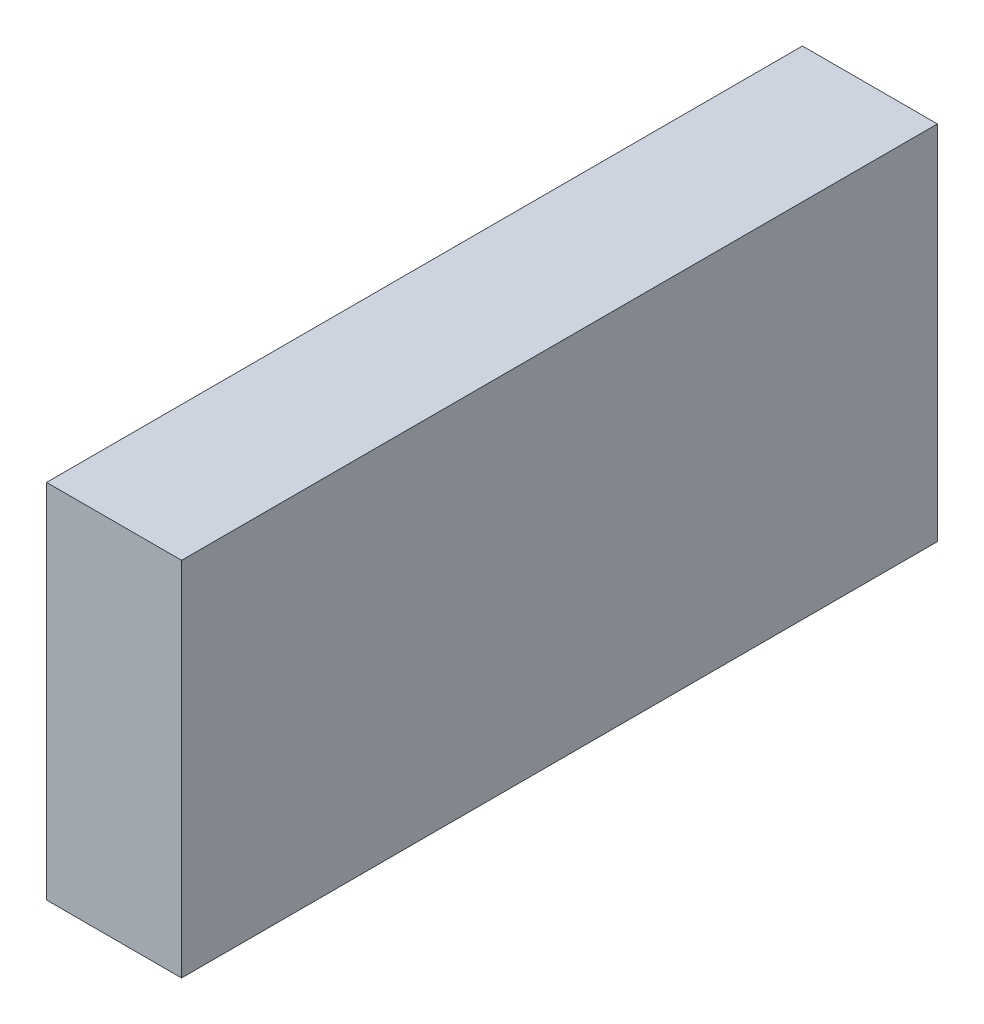
ISO-10303-21;
HEADER;
FILE_DESCRIPTION(('STEP AP214'),'2;1');
FILE_NAME('part.step','',(''),(''),'','','');
FILE_SCHEMA(('AUTOMOTIVE_DESIGN { 1 0 10303 214 1 1 1 1 }'));
ENDSEC;
DATA;
#1=APPLICATION_CONTEXT('core data for automotive mechanical design processes');
#2=APPLICATION_PROTOCOL_DEFINITION('international standard','automotive_design',2000,#1);
#3=PRODUCT_CONTEXT('',#1,'mechanical');
#4=PRODUCT('Part','Part','',(#3));
#5=PRODUCT_RELATED_PRODUCT_CATEGORY('part','',(#4));
#6=PRODUCT_DEFINITION_FORMATION('','',#4);
#7=PRODUCT_DEFINITION_CONTEXT('part definition',#1,'design');
#8=PRODUCT_DEFINITION('design','',#6,#7);
#9=PRODUCT_DEFINITION_SHAPE('','',#8);
#10=(LENGTH_UNIT() NAMED_UNIT(*) SI_UNIT(.MILLI.,.METRE.));
#11=(NAMED_UNIT(*) PLANE_ANGLE_UNIT() SI_UNIT($,.RADIAN.));
#12=(NAMED_UNIT(*) SI_UNIT($,.STERADIAN.) SOLID_ANGLE_UNIT());
#13=UNCERTAINTY_MEASURE_WITH_UNIT(LENGTH_MEASURE(1.E-05),#10,'distance_accuracy_value','');
#14=(GEOMETRIC_REPRESENTATION_CONTEXT(3) GLOBAL_UNCERTAINTY_ASSIGNED_CONTEXT((#13)) GLOBAL_UNIT_ASSIGNED_CONTEXT((#10,
#11,#12)) REPRESENTATION_CONTEXT('',''));
#15=CARTESIAN_POINT('',(0.,0.,0.));
#16=DIRECTION('',(0.,0.,1.));
#17=DIRECTION('',(1.,0.,0.));
#18=AXIS2_PLACEMENT_3D('',#15,#16,#17);
#19=CARTESIAN_POINT('',(0.2499995,-0.6700012,2.79999948));
#20=DIRECTION('',(0.,0.,-1.));
#21=DIRECTION('',(0.,-1.,0.));
#22=AXIS2_PLACEMENT_3D('',#19,#20,#21);
#23=PLANE('',#22);
#24=DIRECTION('',(0.,1.,0.));
#25=VECTOR('',#24,1.);
#26=CARTESIAN_POINT('',(0.2499995,-0.6700012,2.79999948));
#27=LINE('',#26,#25);
#28=CARTESIAN_POINT('',(0.2499995,-0.6700012,2.79999948));
#29=VERTEX_POINT('',#28);
#30=CARTESIAN_POINT('',(0.2499995,0.6700012,2.79999948));
#31=VERTEX_POINT('',#30);
#32=EDGE_CURVE('E88',#29,#31,#27,.T.);
#33=ORIENTED_EDGE('',*,*,#32,.T.);
#34=DIRECTION('',(-1.,0.,0.));
#35=VECTOR('',#34,1.);
#36=CARTESIAN_POINT('',(0.2499995,0.6700012,2.79999948));
#37=LINE('',#36,#35);
#38=CARTESIAN_POINT('',(-0.2499995,0.6700012,2.79999948));
#39=VERTEX_POINT('',#38);
#40=EDGE_CURVE('E83',#31,#39,#37,.T.);
#41=ORIENTED_EDGE('',*,*,#40,.T.);
#42=DIRECTION('',(0.,-1.,0.));
#43=VECTOR('',#42,1.);
#44=CARTESIAN_POINT('',(-0.2499995,0.6700012,2.79999948));
#45=LINE('',#44,#43);
#46=CARTESIAN_POINT('',(-0.2499995,-0.6700012,2.79999948));
#47=VERTEX_POINT('',#46);
#48=EDGE_CURVE('E138',#39,#47,#45,.T.);
#49=ORIENTED_EDGE('',*,*,#48,.T.);
#50=DIRECTION('',(1.,0.,0.));
#51=VECTOR('',#50,1.);
#52=CARTESIAN_POINT('',(-0.2499995,-0.6700012,2.79999948));
#53=LINE('',#52,#51);
#54=EDGE_CURVE('E10',#47,#29,#53,.T.);
#55=ORIENTED_EDGE('',*,*,#54,.T.);
#56=EDGE_LOOP('',(#33,#41,#49,#55));
#57=FACE_BOUND('',#56,.T.);
#58=ADVANCED_FACE('F16',(#57),#23,.F.);
#59=CARTESIAN_POINT('',(0.2499995,-0.6700012,0.));
#60=DIRECTION('',(0.,0.,-1.));
#61=DIRECTION('',(0.,-1.,0.));
#62=AXIS2_PLACEMENT_3D('',#59,#60,#61);
#63=PLANE('',#62);
#64=DIRECTION('',(1.,0.,0.));
#65=VECTOR('',#64,1.);
#66=CARTESIAN_POINT('',(-0.2499995,-0.6700012,0.));
#67=LINE('',#66,#65);
#68=CARTESIAN_POINT('',(-0.2499995,-0.6700012,0.));
#69=VERTEX_POINT('',#68);
#70=CARTESIAN_POINT('',(0.2499995,-0.6700012,0.));
#71=VERTEX_POINT('',#70);
#72=EDGE_CURVE('E27',#69,#71,#67,.T.);
#73=ORIENTED_EDGE('',*,*,#72,.F.);
#74=DIRECTION('',(0.,-1.,0.));
#75=VECTOR('',#74,1.);
#76=CARTESIAN_POINT('',(-0.2499995,0.6700012,0.));
#77=LINE('',#76,#75);
#78=CARTESIAN_POINT('',(-0.2499995,0.6700012,0.));
#79=VERTEX_POINT('',#78);
#80=EDGE_CURVE('E71',#79,#69,#77,.T.);
#81=ORIENTED_EDGE('',*,*,#80,.F.);
#82=DIRECTION('',(-1.,0.,0.));
#83=VECTOR('',#82,1.);
#84=CARTESIAN_POINT('',(0.2499995,0.6700012,0.));
#85=LINE('',#84,#83);
#86=CARTESIAN_POINT('',(0.2499995,0.6700012,0.));
#87=VERTEX_POINT('',#86);
#88=EDGE_CURVE('E67',#87,#79,#85,.T.);
#89=ORIENTED_EDGE('',*,*,#88,.F.);
#90=DIRECTION('',(0.,1.,0.));
#91=VECTOR('',#90,1.);
#92=CARTESIAN_POINT('',(0.2499995,-0.6700012,0.));
#93=LINE('',#92,#91);
#94=EDGE_CURVE('E20',#71,#87,#93,.T.);
#95=ORIENTED_EDGE('',*,*,#94,.F.);
#96=EDGE_LOOP('',(#73,#81,#89,#95));
#97=FACE_BOUND('',#96,.T.);
#98=ADVANCED_FACE('F18',(#97),#63,.T.);
#99=CARTESIAN_POINT('',(-0.2499995,-0.6700012,0.));
#100=DIRECTION('',(0.,1.,0.));
#101=DIRECTION('',(1.,0.,0.));
#102=AXIS2_PLACEMENT_3D('',#99,#100,#101);
#103=PLANE('',#102);
#104=ORIENTED_EDGE('',*,*,#72,.T.);
#105=DIRECTION('',(0.,0.,1.));
#106=VECTOR('',#105,1.);
#107=CARTESIAN_POINT('',(0.2499995,-0.6700012,0.));
#108=LINE('',#107,#106);
#109=EDGE_CURVE('E77',#71,#29,#108,.T.);
#110=ORIENTED_EDGE('',*,*,#109,.T.);
#111=ORIENTED_EDGE('',*,*,#54,.F.);
#112=DIRECTION('',(0.,0.,1.));
#113=VECTOR('',#112,1.);
#114=CARTESIAN_POINT('',(-0.2499995,-0.6700012,0.));
#115=LINE('',#114,#113);
#116=EDGE_CURVE('E130',#69,#47,#115,.T.);
#117=ORIENTED_EDGE('',*,*,#116,.F.);
#118=EDGE_LOOP('',(#104,#110,#111,#117));
#119=FACE_BOUND('',#118,.T.);
#120=ADVANCED_FACE('F177',(#119),#103,.F.);
#121=CARTESIAN_POINT('',(-0.2499995,0.6700012,0.));
#122=DIRECTION('',(1.,0.,0.));
#123=DIRECTION('',(0.,1.,0.));
#124=AXIS2_PLACEMENT_3D('',#121,#122,#123);
#125=PLANE('',#124);
#126=ORIENTED_EDGE('',*,*,#80,.T.);
#127=ORIENTED_EDGE('',*,*,#116,.T.);
#128=ORIENTED_EDGE('',*,*,#48,.F.);
#129=DIRECTION('',(0.,0.,1.));
#130=VECTOR('',#129,1.);
#131=CARTESIAN_POINT('',(-0.2499995,0.6700012,0.));
#132=LINE('',#131,#130);
#133=EDGE_CURVE('E76',#79,#39,#132,.T.);
#134=ORIENTED_EDGE('',*,*,#133,.F.);
#135=EDGE_LOOP('',(#126,#127,#128,#134));
#136=FACE_BOUND('',#135,.T.);
#137=ADVANCED_FACE('F167',(#136),#125,.F.);
#138=CARTESIAN_POINT('',(0.2499995,0.6700012,0.));
#139=DIRECTION('',(0.,-1.,0.));
#140=DIRECTION('',(0.,0.,-1.));
#141=AXIS2_PLACEMENT_3D('',#138,#139,#140);
#142=PLANE('',#141);
#143=ORIENTED_EDGE('',*,*,#88,.T.);
#144=ORIENTED_EDGE('',*,*,#133,.T.);
#145=ORIENTED_EDGE('',*,*,#40,.F.);
#146=DIRECTION('',(0.,0.,1.));
#147=VECTOR('',#146,1.);
#148=CARTESIAN_POINT('',(0.2499995,0.6700012,0.));
#149=LINE('',#148,#147);
#150=EDGE_CURVE('E80',#87,#31,#149,.T.);
#151=ORIENTED_EDGE('',*,*,#150,.F.);
#152=EDGE_LOOP('',(#143,#144,#145,#151));
#153=FACE_BOUND('',#152,.T.);
#154=ADVANCED_FACE('F81',(#153),#142,.F.);
#155=CARTESIAN_POINT('',(0.2499995,-0.6700012,0.));
#156=DIRECTION('',(-1.,0.,0.));
#157=DIRECTION('',(0.,0.,1.));
#158=AXIS2_PLACEMENT_3D('',#155,#156,#157);
#159=PLANE('',#158);
#160=ORIENTED_EDGE('',*,*,#94,.T.);
#161=ORIENTED_EDGE('',*,*,#150,.T.);
#162=ORIENTED_EDGE('',*,*,#32,.F.);
#163=ORIENTED_EDGE('',*,*,#109,.F.);
#164=EDGE_LOOP('',(#160,#161,#162,#163));
#165=FACE_BOUND('',#164,.T.);
#166=ADVANCED_FACE('F91',(#165),#159,.F.);
#167=CLOSED_SHELL('',(#58,#98,#120,#137,#154,#166));
#168=MANIFOLD_SOLID_BREP('B1',#167);
#169=ADVANCED_BREP_SHAPE_REPRESENTATION('',(#18,#168),#14);
#170=SHAPE_DEFINITION_REPRESENTATION(#9,#169);
ENDSEC;
END-ISO-10303-21;
